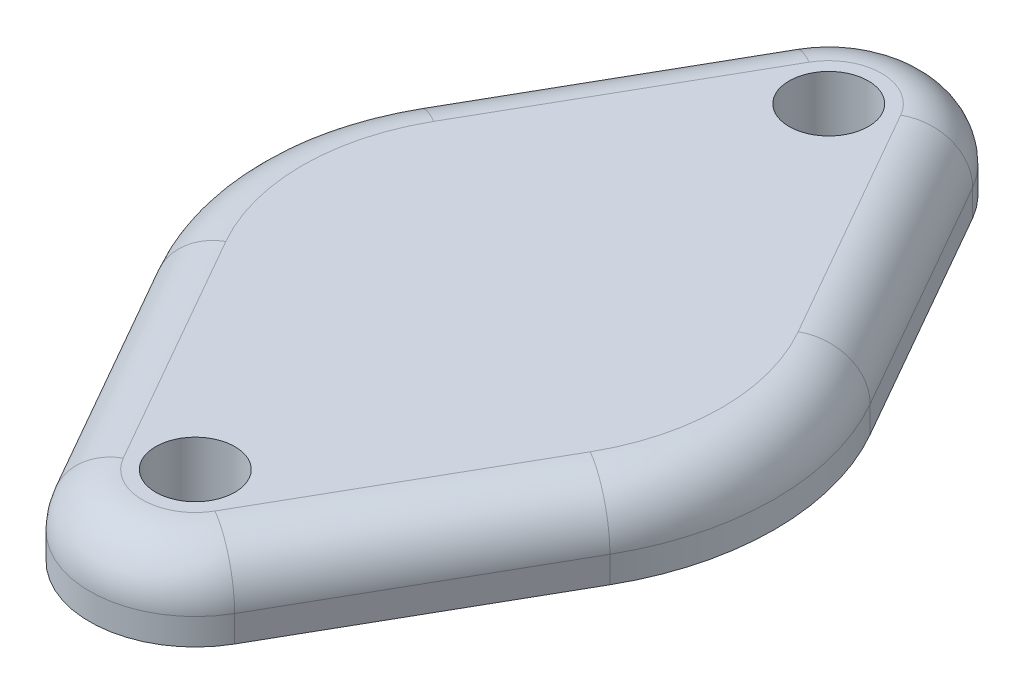
ISO-10303-21;
HEADER;
FILE_DESCRIPTION(('STEP AP214'),'2;1');
FILE_NAME('part.step','',(''),(''),'','','');
FILE_SCHEMA(('AUTOMOTIVE_DESIGN { 1 0 10303 214 1 1 1 1 }'));
ENDSEC;
DATA;
#1=APPLICATION_CONTEXT('core data for automotive mechanical design processes');
#2=APPLICATION_PROTOCOL_DEFINITION('international standard','automotive_design',2000,#1);
#3=PRODUCT_CONTEXT('',#1,'mechanical');
#4=PRODUCT('Part','Part','',(#3));
#5=PRODUCT_RELATED_PRODUCT_CATEGORY('part','',(#4));
#6=PRODUCT_DEFINITION_FORMATION('','',#4);
#7=PRODUCT_DEFINITION_CONTEXT('part definition',#1,'design');
#8=PRODUCT_DEFINITION('design','',#6,#7);
#9=PRODUCT_DEFINITION_SHAPE('','',#8);
#10=(LENGTH_UNIT() NAMED_UNIT(*) SI_UNIT(.MILLI.,.METRE.));
#11=(NAMED_UNIT(*) PLANE_ANGLE_UNIT() SI_UNIT($,.RADIAN.));
#12=(NAMED_UNIT(*) SI_UNIT($,.STERADIAN.) SOLID_ANGLE_UNIT());
#13=UNCERTAINTY_MEASURE_WITH_UNIT(LENGTH_MEASURE(1.E-05),#10,'distance_accuracy_value','');
#14=(GEOMETRIC_REPRESENTATION_CONTEXT(3) GLOBAL_UNCERTAINTY_ASSIGNED_CONTEXT((#13)) GLOBAL_UNIT_ASSIGNED_CONTEXT((#10,
#11,#12)) REPRESENTATION_CONTEXT('',''));
#15=CARTESIAN_POINT('',(0.,0.,0.));
#16=DIRECTION('',(0.,0.,1.));
#17=DIRECTION('',(1.,0.,0.));
#18=AXIS2_PLACEMENT_3D('',#15,#16,#17);
#19=CARTESIAN_POINT('',(0.,3.,0.));
#20=DIRECTION('',(0.,1.,0.));
#21=DIRECTION('',(0.,0.,1.));
#22=AXIS2_PLACEMENT_3D('',#19,#20,#21);
#23=PLANE('',#22);
#24=DIRECTION('',(-0.495620166825858,0.,-0.868539377481245));
#25=VECTOR('',#24,1.);
#26=CARTESIAN_POINT('',(1.73707875496249,3.,-12.9912403336517));
#27=LINE('',#26,#25);
#28=CARTESIAN_POINT('',(6.90266632890746,3.,-3.93891253082559));
#29=VERTEX_POINT('',#28);
#30=CARTESIAN_POINT('',(1.73707875496249,3.,-12.9912403336517));
#31=VERTEX_POINT('',#30);
#32=EDGE_CURVE('E188',#29,#31,#27,.T.);
#33=ORIENTED_EDGE('',*,*,#32,.T.);
#34=CARTESIAN_POINT('',(0.,3.,-12.));
#35=DIRECTION('',(0.,1.,0.));
#36=DIRECTION('',(0.,0.,1.));
#37=AXIS2_PLACEMENT_3D('',#34,#35,#36);
#38=CIRCLE('',#37,2.);
#39=CARTESIAN_POINT('',(-1.73707875496249,3.,-12.9912403336517));
#40=VERTEX_POINT('',#39);
#41=EDGE_CURVE('E190',#31,#40,#38,.T.);
#42=ORIENTED_EDGE('',*,*,#41,.T.);
#43=DIRECTION('',(-0.495620166825856,0.,0.868539377481246));
#44=VECTOR('',#43,1.);
#45=CARTESIAN_POINT('',(-6.90266632890746,3.,-3.93891253082559));
#46=LINE('',#45,#44);
#47=CARTESIAN_POINT('',(-6.90266632890746,3.,-3.93891253082559));
#48=VERTEX_POINT('',#47);
#49=EDGE_CURVE('E127',#40,#48,#46,.T.);
#50=ORIENTED_EDGE('',*,*,#49,.T.);
#51=CARTESIAN_POINT('',(0.,3.,0.));
#52=DIRECTION('',(0.,1.,0.));
#53=DIRECTION('',(0.,0.,1.));
#54=AXIS2_PLACEMENT_3D('',#51,#52,#53);
#55=CIRCLE('',#54,7.94744200191028);
#56=CARTESIAN_POINT('',(-6.90266632890746,3.,3.93891253082559));
#57=VERTEX_POINT('',#56);
#58=EDGE_CURVE('E178',#48,#57,#55,.T.);
#59=ORIENTED_EDGE('',*,*,#58,.T.);
#60=DIRECTION('',(0.495620166825857,0.,0.868539377481246));
#61=VECTOR('',#60,1.);
#62=CARTESIAN_POINT('',(-1.73707875496249,3.,12.9912403336517));
#63=LINE('',#62,#61);
#64=CARTESIAN_POINT('',(-1.73707875496249,3.,12.9912403336517));
#65=VERTEX_POINT('',#64);
#66=EDGE_CURVE('E180',#57,#65,#63,.T.);
#67=ORIENTED_EDGE('',*,*,#66,.T.);
#68=CARTESIAN_POINT('',(0.,3.,12.));
#69=DIRECTION('',(0.,1.,0.));
#70=DIRECTION('',(0.,0.,1.));
#71=AXIS2_PLACEMENT_3D('',#68,#69,#70);
#72=CIRCLE('',#71,2.);
#73=CARTESIAN_POINT('',(1.7370787549625,3.,12.9912403336517));
#74=VERTEX_POINT('',#73);
#75=EDGE_CURVE('E182',#65,#74,#72,.T.);
#76=ORIENTED_EDGE('',*,*,#75,.T.);
#77=DIRECTION('',(0.495620166825856,0.,-0.868539377481246));
#78=VECTOR('',#77,1.);
#79=CARTESIAN_POINT('',(6.90266632890746,3.,3.93891253082559));
#80=LINE('',#79,#78);
#81=CARTESIAN_POINT('',(6.90266632890746,3.,3.93891253082559));
#82=VERTEX_POINT('',#81);
#83=EDGE_CURVE('E184',#74,#82,#80,.T.);
#84=ORIENTED_EDGE('',*,*,#83,.T.);
#85=CARTESIAN_POINT('',(0.,3.,0.));
#86=DIRECTION('',(0.,1.,0.));
#87=DIRECTION('',(0.,0.,1.));
#88=AXIS2_PLACEMENT_3D('',#85,#86,#87);
#89=CIRCLE('',#88,7.94744200191028);
#90=EDGE_CURVE('E186',#82,#29,#89,.T.);
#91=ORIENTED_EDGE('',*,*,#90,.T.);
#92=EDGE_LOOP('',(#33,#42,#50,#59,#67,#76,#84,#91));
#93=FACE_BOUND('',#92,.T.);
#94=CARTESIAN_POINT('',(0.,3.,-12.));
#95=DIRECTION('',(0.,1.,0.));
#96=DIRECTION('',(0.,0.,1.));
#97=AXIS2_PLACEMENT_3D('',#94,#95,#96);
#98=CIRCLE('',#97,1.5);
#99=CARTESIAN_POINT('',(0.,3.,-10.5));
#100=VERTEX_POINT('',#99);
#101=EDGE_CURVE('E143',#100,#100,#98,.T.);
#102=ORIENTED_EDGE('',*,*,#101,.F.);
#103=EDGE_LOOP('',(#102));
#104=FACE_BOUND('',#103,.T.);
#105=CARTESIAN_POINT('',(0.,3.,12.));
#106=DIRECTION('',(0.,1.,0.));
#107=DIRECTION('',(0.,0.,1.));
#108=AXIS2_PLACEMENT_3D('',#105,#106,#107);
#109=CIRCLE('',#108,1.5);
#110=CARTESIAN_POINT('',(0.,3.,13.5));
#111=VERTEX_POINT('',#110);
#112=EDGE_CURVE('E233',#111,#111,#109,.T.);
#113=ORIENTED_EDGE('',*,*,#112,.F.);
#114=EDGE_LOOP('',(#113));
#115=FACE_BOUND('',#114,.T.);
#116=ADVANCED_FACE('F32',(#93,#104,#115),#23,.T.);
#117=CARTESIAN_POINT('',(0.,0.,0.));
#118=DIRECTION('',(0.,1.,0.));
#119=DIRECTION('',(0.,0.,1.));
#120=AXIS2_PLACEMENT_3D('',#117,#118,#119);
#121=PLANE('',#120);
#122=CARTESIAN_POINT('',(0.,0.,0.));
#123=DIRECTION('',(0.,1.,0.));
#124=DIRECTION('',(0.,0.,1.));
#125=AXIS2_PLACEMENT_3D('',#122,#123,#124);
#126=CIRCLE('',#125,9.94744200191028);
#127=CARTESIAN_POINT('',(-8.63974508386995,0.,-4.9301528644773));
#128=VERTEX_POINT('',#127);
#129=CARTESIAN_POINT('',(-8.63974508386995,0.,4.9301528644773));
#130=VERTEX_POINT('',#129);
#131=EDGE_CURVE('E135',#128,#130,#126,.T.);
#132=ORIENTED_EDGE('',*,*,#131,.F.);
#133=DIRECTION('',(-0.495620166825856,0.,0.868539377481246));
#134=VECTOR('',#133,1.);
#135=CARTESIAN_POINT('',(-3.86336336696178,0.,-13.3004248604388));
#136=LINE('',#135,#134);
#137=CARTESIAN_POINT('',(-3.47415750992498,0.,-13.9824806673034));
#138=VERTEX_POINT('',#137);
#139=EDGE_CURVE('E163',#138,#128,#136,.T.);
#140=ORIENTED_EDGE('',*,*,#139,.F.);
#141=CARTESIAN_POINT('',(0.,0.,-12.));
#142=DIRECTION('',(0.,1.,0.));
#143=DIRECTION('',(0.,0.,1.));
#144=AXIS2_PLACEMENT_3D('',#141,#142,#143);
#145=CIRCLE('',#144,4.);
#146=CARTESIAN_POINT('',(3.47415750992498,0.,-13.9824806673034));
#147=VERTEX_POINT('',#146);
#148=EDGE_CURVE('E160',#147,#138,#145,.T.);
#149=ORIENTED_EDGE('',*,*,#148,.F.);
#150=DIRECTION('',(-0.495620166825858,0.,-0.868539377481245));
#151=VECTOR('',#150,1.);
#152=CARTESIAN_POINT('',(3.86336336696179,0.,-13.3004248604388));
#153=LINE('',#152,#151);
#154=CARTESIAN_POINT('',(8.63974508386996,0.,-4.9301528644773));
#155=VERTEX_POINT('',#154);
#156=EDGE_CURVE('E157',#155,#147,#153,.T.);
#157=ORIENTED_EDGE('',*,*,#156,.F.);
#158=CARTESIAN_POINT('',(0.,0.,0.));
#159=DIRECTION('',(0.,1.,0.));
#160=DIRECTION('',(0.,0.,1.));
#161=AXIS2_PLACEMENT_3D('',#158,#159,#160);
#162=CIRCLE('',#161,9.94744200191028);
#163=CARTESIAN_POINT('',(8.63974508386996,0.,4.9301528644773));
#164=VERTEX_POINT('',#163);
#165=EDGE_CURVE('E154',#164,#155,#162,.T.);
#166=ORIENTED_EDGE('',*,*,#165,.F.);
#167=DIRECTION('',(0.495620166825856,0.,-0.868539377481246));
#168=VECTOR('',#167,1.);
#169=CARTESIAN_POINT('',(3.47415750992499,0.,13.9824806673034));
#170=LINE('',#169,#168);
#171=CARTESIAN_POINT('',(3.47415750992499,0.,13.9824806673034));
#172=VERTEX_POINT('',#171);
#173=EDGE_CURVE('E151',#172,#164,#170,.T.);
#174=ORIENTED_EDGE('',*,*,#173,.F.);
#175=CARTESIAN_POINT('',(0.,0.,12.));
#176=DIRECTION('',(0.,1.,0.));
#177=DIRECTION('',(0.,0.,1.));
#178=AXIS2_PLACEMENT_3D('',#175,#176,#177);
#179=CIRCLE('',#178,4.);
#180=CARTESIAN_POINT('',(-3.47415750992498,0.,13.9824806673034));
#181=VERTEX_POINT('',#180);
#182=EDGE_CURVE('E138',#181,#172,#179,.T.);
#183=ORIENTED_EDGE('',*,*,#182,.F.);
#184=DIRECTION('',(0.495620166825857,0.,0.868539377481246));
#185=VECTOR('',#184,1.);
#186=CARTESIAN_POINT('',(-3.47415750992498,0.,13.9824806673034));
#187=LINE('',#186,#185);
#188=EDGE_CURVE('E123',#130,#181,#187,.T.);
#189=ORIENTED_EDGE('',*,*,#188,.F.);
#190=EDGE_LOOP('',(#132,#140,#149,#157,#166,#174,#183,#189));
#191=FACE_BOUND('',#190,.T.);
#192=CARTESIAN_POINT('',(0.,0.,-12.));
#193=DIRECTION('',(0.,1.,0.));
#194=DIRECTION('',(0.,0.,1.));
#195=AXIS2_PLACEMENT_3D('',#192,#193,#194);
#196=CIRCLE('',#195,1.5);
#197=CARTESIAN_POINT('',(0.,0.,-10.5));
#198=VERTEX_POINT('',#197);
#199=EDGE_CURVE('E146',#198,#198,#196,.T.);
#200=ORIENTED_EDGE('',*,*,#199,.T.);
#201=EDGE_LOOP('',(#200));
#202=FACE_BOUND('',#201,.T.);
#203=CARTESIAN_POINT('',(0.,0.,12.));
#204=DIRECTION('',(0.,1.,0.));
#205=DIRECTION('',(0.,0.,1.));
#206=AXIS2_PLACEMENT_3D('',#203,#204,#205);
#207=CIRCLE('',#206,1.5);
#208=CARTESIAN_POINT('',(0.,0.,13.5));
#209=VERTEX_POINT('',#208);
#210=EDGE_CURVE('E227',#209,#209,#207,.T.);
#211=ORIENTED_EDGE('',*,*,#210,.T.);
#212=EDGE_LOOP('',(#211));
#213=FACE_BOUND('',#212,.T.);
#214=ADVANCED_FACE('F132',(#191,#202,#213),#121,.F.);
#215=CARTESIAN_POINT('',(0.,3.,0.));
#216=DIRECTION('',(0.,-1.,0.));
#217=DIRECTION('',(0.,0.,-1.));
#218=AXIS2_PLACEMENT_3D('',#215,#216,#217);
#219=CYLINDRICAL_SURFACE('',#218,9.94744200191028);
#220=DIRECTION('',(0.,-1.,0.));
#221=VECTOR('',#220,1.);
#222=CARTESIAN_POINT('',(-8.63974508386995,3.,4.9301528644773));
#223=LINE('',#222,#221);
#224=CARTESIAN_POINT('',(-8.63974508386995,1.,4.9301528644773));
#225=VERTEX_POINT('',#224);
#226=EDGE_CURVE('E120',#225,#130,#223,.T.);
#227=ORIENTED_EDGE('',*,*,#226,.F.);
#228=CARTESIAN_POINT('',(0.,1.,0.));
#229=DIRECTION('',(0.,1.,0.));
#230=DIRECTION('',(0.,0.,1.));
#231=AXIS2_PLACEMENT_3D('',#228,#229,#230);
#232=CIRCLE('',#231,9.94744200191028);
#233=CARTESIAN_POINT('',(-8.63974508386995,1.,-4.9301528644773));
#234=VERTEX_POINT('',#233);
#235=EDGE_CURVE('E41',#225,#234,#232,.F.);
#236=ORIENTED_EDGE('',*,*,#235,.T.);
#237=DIRECTION('',(0.,-1.,0.));
#238=VECTOR('',#237,1.);
#239=CARTESIAN_POINT('',(-8.63974508386995,3.,-4.9301528644773));
#240=LINE('',#239,#238);
#241=EDGE_CURVE('E141',#234,#128,#240,.T.);
#242=ORIENTED_EDGE('',*,*,#241,.T.);
#243=ORIENTED_EDGE('',*,*,#131,.T.);
#244=EDGE_LOOP('',(#227,#236,#242,#243));
#245=FACE_BOUND('',#244,.T.);
#246=ADVANCED_FACE('F140',(#245),#219,.T.);
#247=CARTESIAN_POINT('',(-3.47415750992498,3.,13.9824806673034));
#248=DIRECTION('',(0.868539377481246,0.,-0.495620166825857));
#249=DIRECTION('',(-0.495620166825857,0.,-0.868539377481246));
#250=AXIS2_PLACEMENT_3D('',#247,#248,#249);
#251=PLANE('',#250);
#252=DIRECTION('',(0.,-1.,0.));
#253=VECTOR('',#252,1.);
#254=CARTESIAN_POINT('',(-3.47415750992498,3.,13.9824806673034));
#255=LINE('',#254,#253);
#256=CARTESIAN_POINT('',(-3.47415750992498,1.,13.9824806673034));
#257=VERTEX_POINT('',#256);
#258=EDGE_CURVE('E128',#257,#181,#255,.T.);
#259=ORIENTED_EDGE('',*,*,#258,.F.);
#260=DIRECTION('',(0.495620166825857,0.,0.868539377481246));
#261=VECTOR('',#260,1.);
#262=CARTESIAN_POINT('',(-8.63974508386995,1.,4.9301528644773));
#263=LINE('',#262,#261);
#264=EDGE_CURVE('E56',#257,#225,#263,.F.);
#265=ORIENTED_EDGE('',*,*,#264,.T.);
#266=ORIENTED_EDGE('',*,*,#226,.T.);
#267=ORIENTED_EDGE('',*,*,#188,.T.);
#268=EDGE_LOOP('',(#259,#265,#266,#267));
#269=FACE_BOUND('',#268,.T.);
#270=ADVANCED_FACE('F122',(#269),#251,.F.);
#271=CARTESIAN_POINT('',(0.,3.,12.));
#272=DIRECTION('',(0.,-1.,0.));
#273=DIRECTION('',(0.,0.,-1.));
#274=AXIS2_PLACEMENT_3D('',#271,#272,#273);
#275=CYLINDRICAL_SURFACE('',#274,4.);
#276=DIRECTION('',(0.,-1.,0.));
#277=VECTOR('',#276,1.);
#278=CARTESIAN_POINT('',(3.47415750992499,3.,13.9824806673034));
#279=LINE('',#278,#277);
#280=CARTESIAN_POINT('',(3.47415750992499,1.,13.9824806673034));
#281=VERTEX_POINT('',#280);
#282=EDGE_CURVE('E174',#281,#172,#279,.T.);
#283=ORIENTED_EDGE('',*,*,#282,.F.);
#284=CARTESIAN_POINT('',(0.,1.,12.));
#285=DIRECTION('',(0.,1.,0.));
#286=DIRECTION('',(0.,0.,1.));
#287=AXIS2_PLACEMENT_3D('',#284,#285,#286);
#288=CIRCLE('',#287,4.);
#289=EDGE_CURVE('E202',#281,#257,#288,.F.);
#290=ORIENTED_EDGE('',*,*,#289,.T.);
#291=ORIENTED_EDGE('',*,*,#258,.T.);
#292=ORIENTED_EDGE('',*,*,#182,.T.);
#293=EDGE_LOOP('',(#283,#290,#291,#292));
#294=FACE_BOUND('',#293,.T.);
#295=ADVANCED_FACE('F281',(#294),#275,.T.);
#296=CARTESIAN_POINT('',(3.47415750992499,3.,13.9824806673034));
#297=DIRECTION('',(-0.868539377481246,0.,-0.495620166825856));
#298=DIRECTION('',(-0.495620166825856,0.,0.868539377481246));
#299=AXIS2_PLACEMENT_3D('',#296,#297,#298);
#300=PLANE('',#299);
#301=DIRECTION('',(0.,-1.,0.));
#302=VECTOR('',#301,1.);
#303=CARTESIAN_POINT('',(8.63974508386996,3.,4.9301528644773));
#304=LINE('',#303,#302);
#305=CARTESIAN_POINT('',(8.63974508386996,1.,4.9301528644773));
#306=VERTEX_POINT('',#305);
#307=EDGE_CURVE('E172',#306,#164,#304,.T.);
#308=ORIENTED_EDGE('',*,*,#307,.F.);
#309=DIRECTION('',(0.495620166825856,0.,-0.868539377481246));
#310=VECTOR('',#309,1.);
#311=CARTESIAN_POINT('',(3.47415750992499,1.,13.9824806673034));
#312=LINE('',#311,#310);
#313=EDGE_CURVE('E200',#306,#281,#312,.F.);
#314=ORIENTED_EDGE('',*,*,#313,.T.);
#315=ORIENTED_EDGE('',*,*,#282,.T.);
#316=ORIENTED_EDGE('',*,*,#173,.T.);
#317=EDGE_LOOP('',(#308,#314,#315,#316));
#318=FACE_BOUND('',#317,.T.);
#319=ADVANCED_FACE('F277',(#318),#300,.F.);
#320=CARTESIAN_POINT('',(0.,3.,0.));
#321=DIRECTION('',(0.,-1.,0.));
#322=DIRECTION('',(0.,0.,-1.));
#323=AXIS2_PLACEMENT_3D('',#320,#321,#322);
#324=CYLINDRICAL_SURFACE('',#323,9.94744200191028);
#325=DIRECTION('',(0.,-1.,0.));
#326=VECTOR('',#325,1.);
#327=CARTESIAN_POINT('',(8.63974508386996,3.,-4.9301528644773));
#328=LINE('',#327,#326);
#329=CARTESIAN_POINT('',(8.63974508386996,1.,-4.9301528644773));
#330=VERTEX_POINT('',#329);
#331=EDGE_CURVE('E170',#330,#155,#328,.T.);
#332=ORIENTED_EDGE('',*,*,#331,.F.);
#333=CARTESIAN_POINT('',(0.,1.,0.));
#334=DIRECTION('',(0.,1.,0.));
#335=DIRECTION('',(0.,0.,1.));
#336=AXIS2_PLACEMENT_3D('',#333,#334,#335);
#337=CIRCLE('',#336,9.94744200191028);
#338=EDGE_CURVE('E198',#330,#306,#337,.F.);
#339=ORIENTED_EDGE('',*,*,#338,.T.);
#340=ORIENTED_EDGE('',*,*,#307,.T.);
#341=ORIENTED_EDGE('',*,*,#165,.T.);
#342=EDGE_LOOP('',(#332,#339,#340,#341));
#343=FACE_BOUND('',#342,.T.);
#344=ADVANCED_FACE('F273',(#343),#324,.T.);
#345=CARTESIAN_POINT('',(3.86336336696179,3.,-13.3004248604388));
#346=DIRECTION('',(-0.868539377481245,0.,0.495620166825857));
#347=DIRECTION('',(0.495620166825858,0.,0.868539377481245));
#348=AXIS2_PLACEMENT_3D('',#345,#346,#347);
#349=PLANE('',#348);
#350=DIRECTION('',(0.,-1.,0.));
#351=VECTOR('',#350,1.);
#352=CARTESIAN_POINT('',(3.47415750992498,3.,-13.9824806673034));
#353=LINE('',#352,#351);
#354=CARTESIAN_POINT('',(3.47415750992498,1.,-13.9824806673034));
#355=VERTEX_POINT('',#354);
#356=EDGE_CURVE('E168',#355,#147,#353,.T.);
#357=ORIENTED_EDGE('',*,*,#356,.F.);
#358=DIRECTION('',(-0.495620166825858,0.,-0.868539377481245));
#359=VECTOR('',#358,1.);
#360=CARTESIAN_POINT('',(8.63974508386996,1.,-4.93015286447731));
#361=LINE('',#360,#359);
#362=EDGE_CURVE('E196',#355,#330,#361,.F.);
#363=ORIENTED_EDGE('',*,*,#362,.T.);
#364=ORIENTED_EDGE('',*,*,#331,.T.);
#365=ORIENTED_EDGE('',*,*,#156,.T.);
#366=EDGE_LOOP('',(#357,#363,#364,#365));
#367=FACE_BOUND('',#366,.T.);
#368=ADVANCED_FACE('F269',(#367),#349,.F.);
#369=CARTESIAN_POINT('',(0.,3.,-12.));
#370=DIRECTION('',(0.,-1.,0.));
#371=DIRECTION('',(0.,0.,-1.));
#372=AXIS2_PLACEMENT_3D('',#369,#370,#371);
#373=CYLINDRICAL_SURFACE('',#372,4.);
#374=DIRECTION('',(0.,-1.,0.));
#375=VECTOR('',#374,1.);
#376=CARTESIAN_POINT('',(-3.47415750992498,3.,-13.9824806673034));
#377=LINE('',#376,#375);
#378=CARTESIAN_POINT('',(-3.47415750992498,1.,-13.9824806673034));
#379=VERTEX_POINT('',#378);
#380=EDGE_CURVE('E166',#379,#138,#377,.T.);
#381=ORIENTED_EDGE('',*,*,#380,.F.);
#382=CARTESIAN_POINT('',(0.,1.,-12.));
#383=DIRECTION('',(0.,1.,0.));
#384=DIRECTION('',(0.,0.,1.));
#385=AXIS2_PLACEMENT_3D('',#382,#383,#384);
#386=CIRCLE('',#385,4.);
#387=EDGE_CURVE('E193',#379,#355,#386,.F.);
#388=ORIENTED_EDGE('',*,*,#387,.T.);
#389=ORIENTED_EDGE('',*,*,#356,.T.);
#390=ORIENTED_EDGE('',*,*,#148,.T.);
#391=EDGE_LOOP('',(#381,#388,#389,#390));
#392=FACE_BOUND('',#391,.T.);
#393=ADVANCED_FACE('F255',(#392),#373,.T.);
#394=CARTESIAN_POINT('',(-3.86336336696178,3.,-13.3004248604388));
#395=DIRECTION('',(0.868539377481246,0.,0.495620166825856));
#396=DIRECTION('',(0.495620166825856,0.,-0.868539377481246));
#397=AXIS2_PLACEMENT_3D('',#394,#395,#396);
#398=PLANE('',#397);
#399=ORIENTED_EDGE('',*,*,#241,.F.);
#400=DIRECTION('',(-0.495620166825856,0.,0.868539377481246));
#401=VECTOR('',#400,1.);
#402=CARTESIAN_POINT('',(-3.47415750992498,1.,-13.9824806673034));
#403=LINE('',#402,#401);
#404=EDGE_CURVE('E11',#234,#379,#403,.F.);
#405=ORIENTED_EDGE('',*,*,#404,.T.);
#406=ORIENTED_EDGE('',*,*,#380,.T.);
#407=ORIENTED_EDGE('',*,*,#139,.T.);
#408=EDGE_LOOP('',(#399,#405,#406,#407));
#409=FACE_BOUND('',#408,.T.);
#410=ADVANCED_FACE('F247',(#409),#398,.F.);
#411=CARTESIAN_POINT('',(0.,3.,-12.));
#412=DIRECTION('',(0.,-1.,0.));
#413=DIRECTION('',(0.,0.,-1.));
#414=AXIS2_PLACEMENT_3D('',#411,#412,#413);
#415=CYLINDRICAL_SURFACE('',#414,1.5);
#416=ORIENTED_EDGE('',*,*,#101,.T.);
#417=EDGE_LOOP('',(#416));
#418=FACE_BOUND('',#417,.T.);
#419=ORIENTED_EDGE('',*,*,#199,.F.);
#420=EDGE_LOOP('',(#419));
#421=FACE_BOUND('',#420,.T.);
#422=ADVANCED_FACE('F244',(#418,#421),#415,.F.);
#423=CARTESIAN_POINT('',(0.,3.,12.));
#424=DIRECTION('',(0.,-1.,0.));
#425=DIRECTION('',(0.,0.,-1.));
#426=AXIS2_PLACEMENT_3D('',#423,#424,#425);
#427=CYLINDRICAL_SURFACE('',#426,1.5);
#428=ORIENTED_EDGE('',*,*,#112,.T.);
#429=EDGE_LOOP('',(#428));
#430=FACE_BOUND('',#429,.T.);
#431=ORIENTED_EDGE('',*,*,#210,.F.);
#432=EDGE_LOOP('',(#431));
#433=FACE_BOUND('',#432,.T.);
#434=ADVANCED_FACE('F246',(#430,#433),#427,.F.);
#435=CARTESIAN_POINT('',(0.,1.,12.));
#436=DIRECTION('',(0.,1.,0.));
#437=DIRECTION('',(0.,0.,1.));
#438=AXIS2_PLACEMENT_3D('',#435,#436,#437);
#439=DEGENERATE_TOROIDAL_SURFACE('',#438,2.,2.,.T.);
#440=CARTESIAN_POINT('',(-1.73707875496249,1.,12.9912403336517));
#441=DIRECTION('',(-0.495620166825856,0.,-0.868539377481246));
#442=DIRECTION('',(-0.868539377481246,0.,0.495620166825856));
#443=AXIS2_PLACEMENT_3D('',#440,#441,#442);
#444=CIRCLE('',#443,2.);
#445=EDGE_CURVE('E221',#257,#65,#444,.T.);
#446=ORIENTED_EDGE('',*,*,#445,.F.);
#447=ORIENTED_EDGE('',*,*,#289,.F.);
#448=CARTESIAN_POINT('',(1.7370787549625,1.,12.9912403336517));
#449=DIRECTION('',(0.495620166825856,0.,-0.868539377481246));
#450=DIRECTION('',(-0.868539377481246,0.,-0.495620166825856));
#451=AXIS2_PLACEMENT_3D('',#448,#449,#450);
#452=CIRCLE('',#451,2.);
#453=EDGE_CURVE('E36',#74,#281,#452,.T.);
#454=ORIENTED_EDGE('',*,*,#453,.F.);
#455=ORIENTED_EDGE('',*,*,#75,.F.);
#456=EDGE_LOOP('',(#446,#447,#454,#455));
#457=FACE_BOUND('',#456,.T.);
#458=ADVANCED_FACE('F34',(#457),#439,.T.);
#459=CARTESIAN_POINT('',(6.90266632890746,1.,3.93891253082559));
#460=DIRECTION('',(-0.495620166825856,0.,0.868539377481246));
#461=DIRECTION('',(0.868539377481246,0.,0.495620166825856));
#462=AXIS2_PLACEMENT_3D('',#459,#460,#461);
#463=CYLINDRICAL_SURFACE('',#462,2.);
#464=ORIENTED_EDGE('',*,*,#453,.T.);
#465=ORIENTED_EDGE('',*,*,#313,.F.);
#466=CARTESIAN_POINT('',(6.90266632890746,1.,3.93891253082559));
#467=DIRECTION('',(0.495620166825856,0.,-0.868539377481246));
#468=DIRECTION('',(-0.868539377481246,0.,-0.495620166825856));
#469=AXIS2_PLACEMENT_3D('',#466,#467,#468);
#470=CIRCLE('',#469,2.);
#471=EDGE_CURVE('E219',#82,#306,#470,.T.);
#472=ORIENTED_EDGE('',*,*,#471,.F.);
#473=ORIENTED_EDGE('',*,*,#83,.F.);
#474=EDGE_LOOP('',(#464,#465,#472,#473));
#475=FACE_BOUND('',#474,.T.);
#476=ADVANCED_FACE('F312',(#475),#463,.T.);
#477=CARTESIAN_POINT('',(-6.90266632890746,1.,3.93891253082559));
#478=DIRECTION('',(-0.495620166825857,0.,-0.868539377481246));
#479=DIRECTION('',(-0.868539377481246,0.,0.495620166825857));
#480=AXIS2_PLACEMENT_3D('',#477,#478,#479);
#481=CYLINDRICAL_SURFACE('',#480,2.);
#482=ORIENTED_EDGE('',*,*,#445,.T.);
#483=ORIENTED_EDGE('',*,*,#66,.F.);
#484=CARTESIAN_POINT('',(-6.90266632890746,1.,3.93891253082559));
#485=DIRECTION('',(-0.495620166825857,0.,-0.868539377481246));
#486=DIRECTION('',(-0.868539377481246,0.,0.495620166825857));
#487=AXIS2_PLACEMENT_3D('',#484,#485,#486);
#488=CIRCLE('',#487,2.);
#489=EDGE_CURVE('E216',#225,#57,#488,.T.);
#490=ORIENTED_EDGE('',*,*,#489,.F.);
#491=ORIENTED_EDGE('',*,*,#264,.F.);
#492=EDGE_LOOP('',(#482,#483,#490,#491));
#493=FACE_BOUND('',#492,.T.);
#494=ADVANCED_FACE('F309',(#493),#481,.T.);
#495=CARTESIAN_POINT('',(0.,1.,0.));
#496=DIRECTION('',(0.,1.,0.));
#497=DIRECTION('',(0.,0.,1.));
#498=AXIS2_PLACEMENT_3D('',#495,#496,#497);
#499=TOROIDAL_SURFACE('',#498,7.94744200191028,2.);
#500=ORIENTED_EDGE('',*,*,#471,.T.);
#501=ORIENTED_EDGE('',*,*,#338,.F.);
#502=CARTESIAN_POINT('',(6.90266632890746,1.,-3.93891253082559));
#503=DIRECTION('',(-0.495620166825857,0.,-0.868539377481246));
#504=DIRECTION('',(-0.868539377481246,0.,0.495620166825857));
#505=AXIS2_PLACEMENT_3D('',#502,#503,#504);
#506=CIRCLE('',#505,2.);
#507=EDGE_CURVE('E213',#29,#330,#506,.T.);
#508=ORIENTED_EDGE('',*,*,#507,.F.);
#509=ORIENTED_EDGE('',*,*,#90,.F.);
#510=EDGE_LOOP('',(#500,#501,#508,#509));
#511=FACE_BOUND('',#510,.T.);
#512=ADVANCED_FACE('F305',(#511),#499,.T.);
#513=CARTESIAN_POINT('',(0.,1.,0.));
#514=DIRECTION('',(0.,1.,0.));
#515=DIRECTION('',(0.,0.,1.));
#516=AXIS2_PLACEMENT_3D('',#513,#514,#515);
#517=TOROIDAL_SURFACE('',#516,7.94744200191028,2.);
#518=ORIENTED_EDGE('',*,*,#489,.T.);
#519=ORIENTED_EDGE('',*,*,#58,.F.);
#520=CARTESIAN_POINT('',(-6.90266632890746,1.,-3.93891253082559));
#521=DIRECTION('',(0.495620166825857,0.,-0.868539377481246));
#522=DIRECTION('',(-0.868539377481246,0.,-0.495620166825857));
#523=AXIS2_PLACEMENT_3D('',#520,#521,#522);
#524=CIRCLE('',#523,2.);
#525=EDGE_CURVE('E210',#234,#48,#524,.T.);
#526=ORIENTED_EDGE('',*,*,#525,.F.);
#527=ORIENTED_EDGE('',*,*,#235,.F.);
#528=EDGE_LOOP('',(#518,#519,#526,#527));
#529=FACE_BOUND('',#528,.T.);
#530=ADVANCED_FACE('F301',(#529),#517,.T.);
#531=CARTESIAN_POINT('',(6.90266632890747,1.,-3.93891253082561));
#532=DIRECTION('',(0.495620166825858,0.,0.868539377481245));
#533=DIRECTION('',(0.868539377481245,0.,-0.495620166825858));
#534=AXIS2_PLACEMENT_3D('',#531,#532,#533);
#535=CYLINDRICAL_SURFACE('',#534,2.);
#536=ORIENTED_EDGE('',*,*,#507,.T.);
#537=ORIENTED_EDGE('',*,*,#362,.F.);
#538=CARTESIAN_POINT('',(1.73707875496249,1.,-12.9912403336517));
#539=DIRECTION('',(-0.495620166825857,0.,-0.868539377481246));
#540=DIRECTION('',(-0.868539377481246,0.,0.495620166825857));
#541=AXIS2_PLACEMENT_3D('',#538,#539,#540);
#542=CIRCLE('',#541,2.);
#543=EDGE_CURVE('E208',#31,#355,#542,.T.);
#544=ORIENTED_EDGE('',*,*,#543,.F.);
#545=ORIENTED_EDGE('',*,*,#32,.F.);
#546=EDGE_LOOP('',(#536,#537,#544,#545));
#547=FACE_BOUND('',#546,.T.);
#548=ADVANCED_FACE('F297',(#547),#535,.T.);
#549=CARTESIAN_POINT('',(-6.90266632890746,1.,-3.93891253082559));
#550=DIRECTION('',(0.495620166825856,0.,-0.868539377481246));
#551=DIRECTION('',(-0.868539377481246,0.,-0.495620166825856));
#552=AXIS2_PLACEMENT_3D('',#549,#550,#551);
#553=CYLINDRICAL_SURFACE('',#552,2.);
#554=ORIENTED_EDGE('',*,*,#525,.T.);
#555=ORIENTED_EDGE('',*,*,#49,.F.);
#556=CARTESIAN_POINT('',(-1.73707875496249,1.,-12.9912403336517));
#557=DIRECTION('',(0.495620166825856,0.,-0.868539377481246));
#558=DIRECTION('',(-0.868539377481246,0.,-0.495620166825856));
#559=AXIS2_PLACEMENT_3D('',#556,#557,#558);
#560=CIRCLE('',#559,2.);
#561=EDGE_CURVE('E206',#379,#40,#560,.T.);
#562=ORIENTED_EDGE('',*,*,#561,.F.);
#563=ORIENTED_EDGE('',*,*,#404,.F.);
#564=EDGE_LOOP('',(#554,#555,#562,#563));
#565=FACE_BOUND('',#564,.T.);
#566=ADVANCED_FACE('F293',(#565),#553,.T.);
#567=CARTESIAN_POINT('',(0.,1.,-12.));
#568=DIRECTION('',(0.,1.,0.));
#569=DIRECTION('',(0.,0.,1.));
#570=AXIS2_PLACEMENT_3D('',#567,#568,#569);
#571=DEGENERATE_TOROIDAL_SURFACE('',#570,2.,2.,.T.);
#572=ORIENTED_EDGE('',*,*,#543,.T.);
#573=ORIENTED_EDGE('',*,*,#387,.F.);
#574=ORIENTED_EDGE('',*,*,#561,.T.);
#575=ORIENTED_EDGE('',*,*,#41,.F.);
#576=EDGE_LOOP('',(#572,#573,#574,#575));
#577=FACE_BOUND('',#576,.T.);
#578=ADVANCED_FACE('F290',(#577),#571,.T.);
#579=CLOSED_SHELL('',(#116,#214,#246,#270,#295,#319,#344,#368,#393,#410,#422,#434,#458,#476,
#494,#512,#530,#548,#566,#578));
#580=MANIFOLD_SOLID_BREP('B2',#579);
#581=ADVANCED_BREP_SHAPE_REPRESENTATION('',(#18,#580),#14);
#582=SHAPE_DEFINITION_REPRESENTATION(#9,#581);
ENDSEC;
END-ISO-10303-21;
